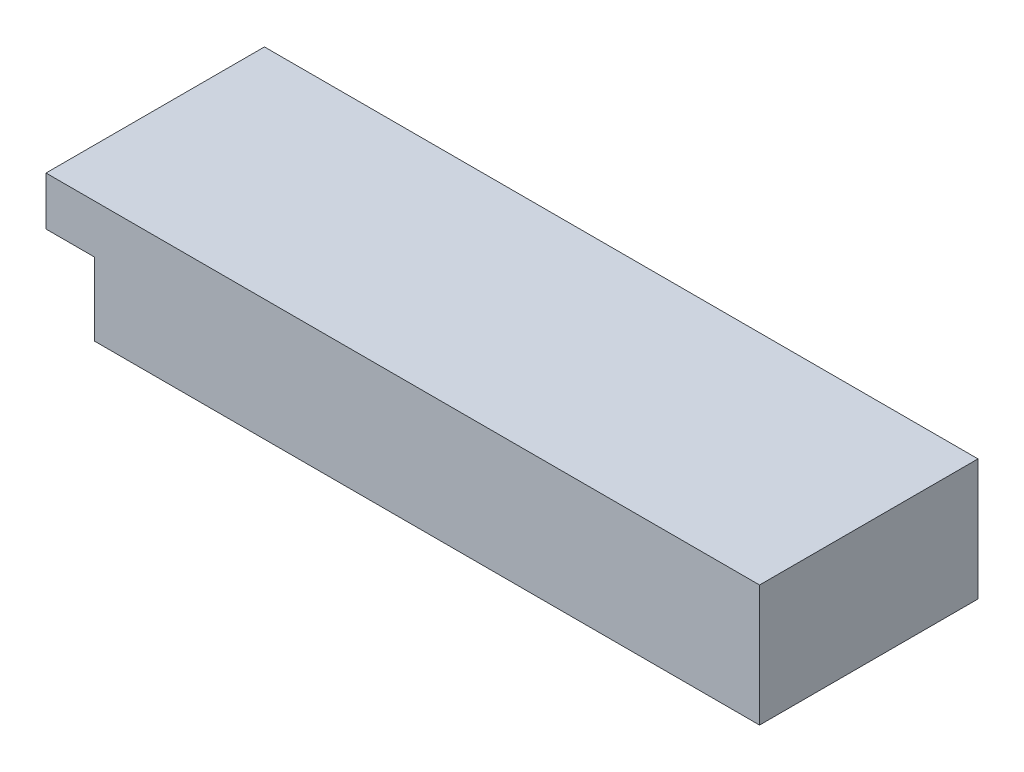
ISO-10303-21;
HEADER;
FILE_DESCRIPTION(('STEP AP214'),'2;1');
FILE_NAME('part.step','',(''),(''),'','','');
FILE_SCHEMA(('AUTOMOTIVE_DESIGN { 1 0 10303 214 1 1 1 1 }'));
ENDSEC;
DATA;
#1=APPLICATION_CONTEXT('core data for automotive mechanical design processes');
#2=APPLICATION_PROTOCOL_DEFINITION('international standard','automotive_design',2000,#1);
#3=PRODUCT_CONTEXT('',#1,'mechanical');
#4=PRODUCT('Part','Part','',(#3));
#5=PRODUCT_RELATED_PRODUCT_CATEGORY('part','',(#4));
#6=PRODUCT_DEFINITION_FORMATION('','',#4);
#7=PRODUCT_DEFINITION_CONTEXT('part definition',#1,'design');
#8=PRODUCT_DEFINITION('design','',#6,#7);
#9=PRODUCT_DEFINITION_SHAPE('','',#8);
#10=(LENGTH_UNIT() NAMED_UNIT(*) SI_UNIT(.MILLI.,.METRE.));
#11=(NAMED_UNIT(*) PLANE_ANGLE_UNIT() SI_UNIT($,.RADIAN.));
#12=(NAMED_UNIT(*) SI_UNIT($,.STERADIAN.) SOLID_ANGLE_UNIT());
#13=UNCERTAINTY_MEASURE_WITH_UNIT(LENGTH_MEASURE(1.E-05),#10,'distance_accuracy_value','');
#14=(GEOMETRIC_REPRESENTATION_CONTEXT(3) GLOBAL_UNCERTAINTY_ASSIGNED_CONTEXT((#13)) GLOBAL_UNIT_ASSIGNED_CONTEXT((#10,
#11,#12)) REPRESENTATION_CONTEXT('',''));
#15=CARTESIAN_POINT('',(0.,0.,0.));
#16=DIRECTION('',(0.,0.,1.));
#17=DIRECTION('',(1.,0.,0.));
#18=AXIS2_PLACEMENT_3D('',#15,#16,#17);
#19=CARTESIAN_POINT('',(0.,25.,0.));
#20=DIRECTION('',(1.,0.,0.));
#21=DIRECTION('',(0.,0.,-1.));
#22=AXIS2_PLACEMENT_3D('',#19,#20,#21);
#23=PLANE('',#22);
#24=DIRECTION('',(0.,0.,1.));
#25=VECTOR('',#24,1.);
#26=CARTESIAN_POINT('',(0.,15.,-45.));
#27=LINE('',#26,#25);
#28=CARTESIAN_POINT('',(0.,15.,-45.));
#29=VERTEX_POINT('',#28);
#30=CARTESIAN_POINT('',(0.,15.,0.));
#31=VERTEX_POINT('',#30);
#32=EDGE_CURVE('E50',#29,#31,#27,.T.);
#33=ORIENTED_EDGE('',*,*,#32,.F.);
#34=DIRECTION('',(0.,-1.,0.));
#35=VECTOR('',#34,1.);
#36=CARTESIAN_POINT('',(0.,25.,-45.));
#37=LINE('',#36,#35);
#38=CARTESIAN_POINT('',(0.,0.,-45.));
#39=VERTEX_POINT('',#38);
#40=EDGE_CURVE('E74',#29,#39,#37,.T.);
#41=ORIENTED_EDGE('',*,*,#40,.T.);
#42=DIRECTION('',(0.,0.,1.));
#43=VECTOR('',#42,1.);
#44=CARTESIAN_POINT('',(0.,0.,0.));
#45=LINE('',#44,#43);
#46=CARTESIAN_POINT('',(0.,0.,0.));
#47=VERTEX_POINT('',#46);
#48=EDGE_CURVE('E77',#39,#47,#45,.T.);
#49=ORIENTED_EDGE('',*,*,#48,.T.);
#50=DIRECTION('',(0.,-1.,0.));
#51=VECTOR('',#50,1.);
#52=CARTESIAN_POINT('',(0.,25.,0.));
#53=LINE('',#52,#51);
#54=EDGE_CURVE('E11',#31,#47,#53,.T.);
#55=ORIENTED_EDGE('',*,*,#54,.F.);
#56=EDGE_LOOP('',(#33,#41,#49,#55));
#57=FACE_BOUND('',#56,.T.);
#58=ADVANCED_FACE('F36',(#57),#23,.F.);
#59=CARTESIAN_POINT('',(0.,25.,0.));
#60=DIRECTION('',(0.,0.,-1.));
#61=DIRECTION('',(-1.,0.,0.));
#62=AXIS2_PLACEMENT_3D('',#59,#60,#61);
#63=PLANE('',#62);
#64=DIRECTION('',(1.,0.,0.));
#65=VECTOR('',#64,1.);
#66=CARTESIAN_POINT('',(0.,0.,0.));
#67=LINE('',#66,#65);
#68=CARTESIAN_POINT('',(137.,0.,0.));
#69=VERTEX_POINT('',#68);
#70=EDGE_CURVE('E96',#47,#69,#67,.T.);
#71=ORIENTED_EDGE('',*,*,#70,.T.);
#72=DIRECTION('',(0.,-1.,0.));
#73=VECTOR('',#72,1.);
#74=CARTESIAN_POINT('',(137.,25.,0.));
#75=LINE('',#74,#73);
#76=CARTESIAN_POINT('',(137.,25.,0.));
#77=VERTEX_POINT('',#76);
#78=EDGE_CURVE('E43',#77,#69,#75,.T.);
#79=ORIENTED_EDGE('',*,*,#78,.F.);
#80=DIRECTION('',(1.,0.,0.));
#81=VECTOR('',#80,1.);
#82=CARTESIAN_POINT('',(0.,25.,0.));
#83=LINE('',#82,#81);
#84=CARTESIAN_POINT('',(-10.,25.,0.));
#85=VERTEX_POINT('',#84);
#86=EDGE_CURVE('E91',#85,#77,#83,.T.);
#87=ORIENTED_EDGE('',*,*,#86,.F.);
#88=DIRECTION('',(0.,1.,0.));
#89=VECTOR('',#88,1.);
#90=CARTESIAN_POINT('',(-10.,25.,0.));
#91=LINE('',#90,#89);
#92=CARTESIAN_POINT('',(-10.,15.,0.));
#93=VERTEX_POINT('',#92);
#94=EDGE_CURVE('E142',#93,#85,#91,.T.);
#95=ORIENTED_EDGE('',*,*,#94,.F.);
#96=DIRECTION('',(1.,0.,0.));
#97=VECTOR('',#96,1.);
#98=CARTESIAN_POINT('',(-10.,15.,0.));
#99=LINE('',#98,#97);
#100=EDGE_CURVE('E100',#93,#31,#99,.T.);
#101=ORIENTED_EDGE('',*,*,#100,.T.);
#102=ORIENTED_EDGE('',*,*,#54,.T.);
#103=EDGE_LOOP('',(#71,#79,#87,#95,#101,#102));
#104=FACE_BOUND('',#103,.T.);
#105=ADVANCED_FACE('F112',(#104),#63,.F.);
#106=CARTESIAN_POINT('',(137.,25.,0.));
#107=DIRECTION('',(-1.,0.,0.));
#108=DIRECTION('',(0.,0.,1.));
#109=AXIS2_PLACEMENT_3D('',#106,#107,#108);
#110=PLANE('',#109);
#111=DIRECTION('',(0.,0.,-1.));
#112=VECTOR('',#111,1.);
#113=CARTESIAN_POINT('',(137.,0.,0.));
#114=LINE('',#113,#112);
#115=CARTESIAN_POINT('',(137.,0.,-45.));
#116=VERTEX_POINT('',#115);
#117=EDGE_CURVE('E92',#69,#116,#114,.T.);
#118=ORIENTED_EDGE('',*,*,#117,.T.);
#119=DIRECTION('',(0.,-1.,0.));
#120=VECTOR('',#119,1.);
#121=CARTESIAN_POINT('',(137.,25.,-45.));
#122=LINE('',#121,#120);
#123=CARTESIAN_POINT('',(137.,25.,-45.));
#124=VERTEX_POINT('',#123);
#125=EDGE_CURVE('E81',#124,#116,#122,.T.);
#126=ORIENTED_EDGE('',*,*,#125,.F.);
#127=DIRECTION('',(0.,0.,-1.));
#128=VECTOR('',#127,1.);
#129=CARTESIAN_POINT('',(137.,25.,0.));
#130=LINE('',#129,#128);
#131=EDGE_CURVE('E59',#77,#124,#130,.T.);
#132=ORIENTED_EDGE('',*,*,#131,.F.);
#133=ORIENTED_EDGE('',*,*,#78,.T.);
#134=EDGE_LOOP('',(#118,#126,#132,#133));
#135=FACE_BOUND('',#134,.T.);
#136=ADVANCED_FACE('F109',(#135),#110,.F.);
#137=CARTESIAN_POINT('',(0.,25.,-45.));
#138=DIRECTION('',(0.,0.,1.));
#139=DIRECTION('',(1.,0.,0.));
#140=AXIS2_PLACEMENT_3D('',#137,#138,#139);
#141=PLANE('',#140);
#142=DIRECTION('',(-1.,0.,0.));
#143=VECTOR('',#142,1.);
#144=CARTESIAN_POINT('',(0.,0.,-45.));
#145=LINE('',#144,#143);
#146=EDGE_CURVE('E86',#116,#39,#145,.T.);
#147=ORIENTED_EDGE('',*,*,#146,.T.);
#148=ORIENTED_EDGE('',*,*,#40,.F.);
#149=DIRECTION('',(1.,0.,0.));
#150=VECTOR('',#149,1.);
#151=CARTESIAN_POINT('',(-10.,15.,-45.));
#152=LINE('',#151,#150);
#153=CARTESIAN_POINT('',(-10.,15.,-45.));
#154=VERTEX_POINT('',#153);
#155=EDGE_CURVE('E97',#154,#29,#152,.T.);
#156=ORIENTED_EDGE('',*,*,#155,.F.);
#157=DIRECTION('',(0.,-1.,0.));
#158=VECTOR('',#157,1.);
#159=CARTESIAN_POINT('',(-10.,25.,-45.));
#160=LINE('',#159,#158);
#161=CARTESIAN_POINT('',(-10.,25.,-45.));
#162=VERTEX_POINT('',#161);
#163=EDGE_CURVE('E124',#162,#154,#160,.T.);
#164=ORIENTED_EDGE('',*,*,#163,.F.);
#165=DIRECTION('',(-1.,0.,0.));
#166=VECTOR('',#165,1.);
#167=CARTESIAN_POINT('',(0.,25.,-45.));
#168=LINE('',#167,#166);
#169=EDGE_CURVE('E82',#124,#162,#168,.T.);
#170=ORIENTED_EDGE('',*,*,#169,.F.);
#171=ORIENTED_EDGE('',*,*,#125,.T.);
#172=EDGE_LOOP('',(#147,#148,#156,#164,#170,#171));
#173=FACE_BOUND('',#172,.T.);
#174=ADVANCED_FACE('F87',(#173),#141,.F.);
#175=CARTESIAN_POINT('',(0.,25.,0.));
#176=DIRECTION('',(0.,-1.,0.));
#177=DIRECTION('',(0.,0.,-1.));
#178=AXIS2_PLACEMENT_3D('',#175,#176,#177);
#179=PLANE('',#178);
#180=ORIENTED_EDGE('',*,*,#169,.T.);
#181=DIRECTION('',(0.,0.,-1.));
#182=VECTOR('',#181,1.);
#183=CARTESIAN_POINT('',(-10.,25.,-45.));
#184=LINE('',#183,#182);
#185=EDGE_CURVE('E131',#85,#162,#184,.T.);
#186=ORIENTED_EDGE('',*,*,#185,.F.);
#187=ORIENTED_EDGE('',*,*,#86,.T.);
#188=ORIENTED_EDGE('',*,*,#131,.T.);
#189=EDGE_LOOP('',(#180,#186,#187,#188));
#190=FACE_BOUND('',#189,.T.);
#191=ADVANCED_FACE('F136',(#190),#179,.F.);
#192=CARTESIAN_POINT('',(0.,0.,0.));
#193=DIRECTION('',(0.,-1.,0.));
#194=DIRECTION('',(0.,0.,-1.));
#195=AXIS2_PLACEMENT_3D('',#192,#193,#194);
#196=PLANE('',#195);
#197=ORIENTED_EDGE('',*,*,#48,.F.);
#198=ORIENTED_EDGE('',*,*,#146,.F.);
#199=ORIENTED_EDGE('',*,*,#117,.F.);
#200=ORIENTED_EDGE('',*,*,#70,.F.);
#201=EDGE_LOOP('',(#197,#198,#199,#200));
#202=FACE_BOUND('',#201,.T.);
#203=ADVANCED_FACE('F95',(#202),#196,.T.);
#204=CARTESIAN_POINT('',(-10.,15.,-45.));
#205=DIRECTION('',(0.,1.,0.));
#206=DIRECTION('',(0.,0.,1.));
#207=AXIS2_PLACEMENT_3D('',#204,#205,#206);
#208=PLANE('',#207);
#209=ORIENTED_EDGE('',*,*,#32,.T.);
#210=ORIENTED_EDGE('',*,*,#100,.F.);
#211=DIRECTION('',(0.,0.,1.));
#212=VECTOR('',#211,1.);
#213=CARTESIAN_POINT('',(-10.,15.,-45.));
#214=LINE('',#213,#212);
#215=EDGE_CURVE('E127',#154,#93,#214,.T.);
#216=ORIENTED_EDGE('',*,*,#215,.F.);
#217=ORIENTED_EDGE('',*,*,#155,.T.);
#218=EDGE_LOOP('',(#209,#210,#216,#217));
#219=FACE_BOUND('',#218,.T.);
#220=ADVANCED_FACE('F121',(#219),#208,.F.);
#221=CARTESIAN_POINT('',(-10.,0.,0.));
#222=DIRECTION('',(-1.,0.,0.));
#223=DIRECTION('',(0.,0.,1.));
#224=AXIS2_PLACEMENT_3D('',#221,#222,#223);
#225=PLANE('',#224);
#226=ORIENTED_EDGE('',*,*,#163,.T.);
#227=ORIENTED_EDGE('',*,*,#215,.T.);
#228=ORIENTED_EDGE('',*,*,#94,.T.);
#229=ORIENTED_EDGE('',*,*,#185,.T.);
#230=EDGE_LOOP('',(#226,#227,#228,#229));
#231=FACE_BOUND('',#230,.T.);
#232=ADVANCED_FACE('F140',(#231),#225,.T.);
#233=CLOSED_SHELL('',(#58,#105,#136,#174,#191,#203,#220,#232));
#234=MANIFOLD_SOLID_BREP('B2',#233);
#235=ADVANCED_BREP_SHAPE_REPRESENTATION('',(#18,#234),#14);
#236=SHAPE_DEFINITION_REPRESENTATION(#9,#235);
ENDSEC;
END-ISO-10303-21;
